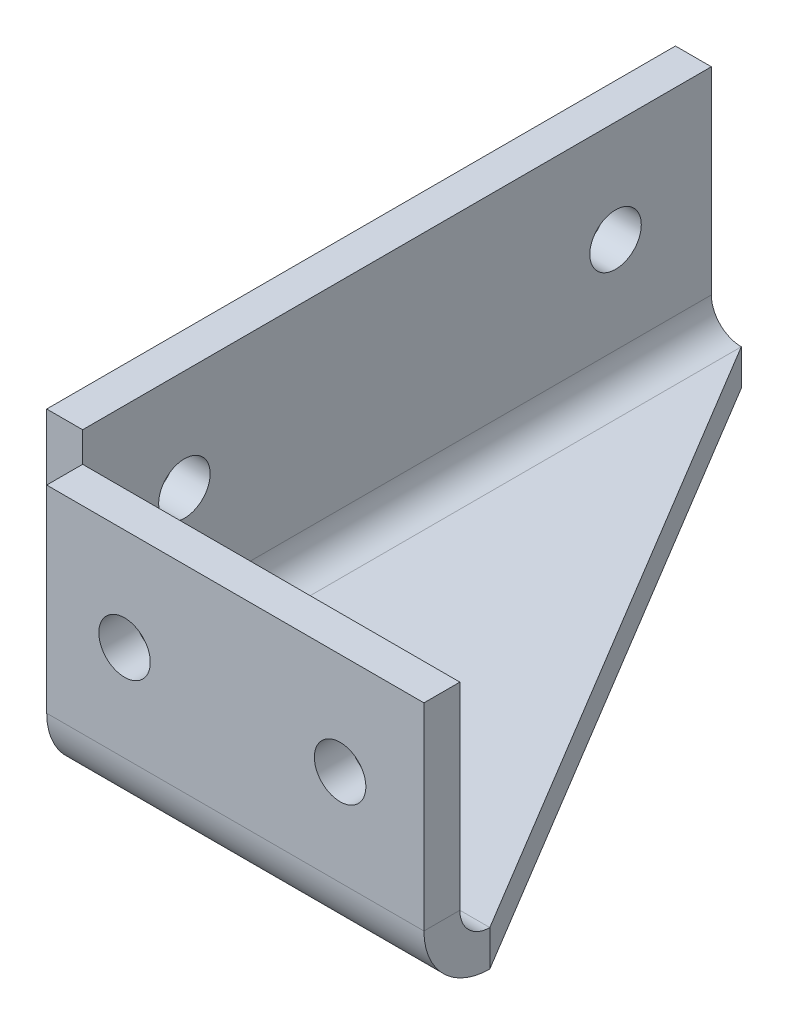
ISO-10303-21;
HEADER;
FILE_DESCRIPTION(('STEP AP214'),'2;1');
FILE_NAME('part.step','',(''),(''),'','','');
FILE_SCHEMA(('AUTOMOTIVE_DESIGN { 1 0 10303 214 1 1 1 1 }'));
ENDSEC;
DATA;
#1=APPLICATION_CONTEXT('core data for automotive mechanical design processes');
#2=APPLICATION_PROTOCOL_DEFINITION('international standard','automotive_design',2000,#1);
#3=PRODUCT_CONTEXT('',#1,'mechanical');
#4=PRODUCT('Part','Part','',(#3));
#5=PRODUCT_RELATED_PRODUCT_CATEGORY('part','',(#4));
#6=PRODUCT_DEFINITION_FORMATION('','',#4);
#7=PRODUCT_DEFINITION_CONTEXT('part definition',#1,'design');
#8=PRODUCT_DEFINITION('design','',#6,#7);
#9=PRODUCT_DEFINITION_SHAPE('','',#8);
#10=(LENGTH_UNIT() NAMED_UNIT(*) SI_UNIT(.MILLI.,.METRE.));
#11=(NAMED_UNIT(*) PLANE_ANGLE_UNIT() SI_UNIT($,.RADIAN.));
#12=(NAMED_UNIT(*) SI_UNIT($,.STERADIAN.) SOLID_ANGLE_UNIT());
#13=UNCERTAINTY_MEASURE_WITH_UNIT(LENGTH_MEASURE(1.E-05),#10,'distance_accuracy_value','');
#14=(GEOMETRIC_REPRESENTATION_CONTEXT(3) GLOBAL_UNCERTAINTY_ASSIGNED_CONTEXT((#13)) GLOBAL_UNIT_ASSIGNED_CONTEXT((#10,
#11,#12)) REPRESENTATION_CONTEXT('',''));
#15=CARTESIAN_POINT('',(0.,0.,0.));
#16=DIRECTION('',(0.,0.,1.));
#17=DIRECTION('',(1.,0.,0.));
#18=AXIS2_PLACEMENT_3D('',#15,#16,#17);
#19=CARTESIAN_POINT('',(0.,-3.,0.));
#20=DIRECTION('',(0.,1.,0.));
#21=DIRECTION('',(0.,0.,1.));
#22=AXIS2_PLACEMENT_3D('',#19,#20,#21);
#23=PLANE('',#22);
#24=DIRECTION('',(0.514495755427527,0.,0.857492925712544));
#25=VECTOR('',#24,1.);
#26=CARTESIAN_POINT('',(0.,-3.,0.));
#27=LINE('',#26,#25);
#28=CARTESIAN_POINT('',(-31.5,-3.,-52.5));
#29=VERTEX_POINT('',#28);
#30=CARTESIAN_POINT('',(0.,-3.,0.));
#31=VERTEX_POINT('',#30);
#32=EDGE_CURVE('E95',#29,#31,#27,.T.);
#33=ORIENTED_EDGE('',*,*,#32,.T.);
#34=DIRECTION('',(1.,0.,0.));
#35=VECTOR('',#34,1.);
#36=CARTESIAN_POINT('',(0.,-3.,0.));
#37=LINE('',#36,#35);
#38=CARTESIAN_POINT('',(-31.5,-2.99999999999999,0.));
#39=VERTEX_POINT('',#38);
#40=EDGE_CURVE('E196',#39,#31,#37,.T.);
#41=ORIENTED_EDGE('',*,*,#40,.F.);
#42=DIRECTION('',(0.,0.,1.));
#43=VECTOR('',#42,1.);
#44=CARTESIAN_POINT('',(-31.5,-3.,0.));
#45=LINE('',#44,#43);
#46=EDGE_CURVE('E172',#29,#39,#45,.T.);
#47=ORIENTED_EDGE('',*,*,#46,.F.);
#48=EDGE_LOOP('',(#33,#41,#47));
#49=FACE_BOUND('',#48,.T.);
#50=ADVANCED_FACE('F78',(#49),#23,.F.);
#51=CARTESIAN_POINT('',(0.,0.,0.));
#52=DIRECTION('',(0.,1.,0.));
#53=DIRECTION('',(0.,0.,1.));
#54=AXIS2_PLACEMENT_3D('',#51,#52,#53);
#55=PLANE('',#54);
#56=DIRECTION('',(1.,0.,0.));
#57=VECTOR('',#56,1.);
#58=CARTESIAN_POINT('',(0.,0.,0.));
#59=LINE('',#58,#57);
#60=CARTESIAN_POINT('',(-31.5,0.,0.));
#61=VERTEX_POINT('',#60);
#62=CARTESIAN_POINT('',(0.,0.,0.));
#63=VERTEX_POINT('',#62);
#64=EDGE_CURVE('E166',#61,#63,#59,.T.);
#65=ORIENTED_EDGE('',*,*,#64,.T.);
#66=DIRECTION('',(0.514495755427527,0.,0.857492925712544));
#67=VECTOR('',#66,1.);
#68=CARTESIAN_POINT('',(0.,0.,0.));
#69=LINE('',#68,#67);
#70=CARTESIAN_POINT('',(-31.5,0.,-52.5));
#71=VERTEX_POINT('',#70);
#72=EDGE_CURVE('E157',#71,#63,#69,.T.);
#73=ORIENTED_EDGE('',*,*,#72,.F.);
#74=DIRECTION('',(0.,0.,1.));
#75=VECTOR('',#74,1.);
#76=CARTESIAN_POINT('',(-31.5,0.,0.));
#77=LINE('',#76,#75);
#78=EDGE_CURVE('E167',#71,#61,#77,.T.);
#79=ORIENTED_EDGE('',*,*,#78,.T.);
#80=EDGE_LOOP('',(#65,#73,#79));
#81=FACE_BOUND('',#80,.T.);
#82=ADVANCED_FACE('F80',(#81),#55,.T.);
#83=CARTESIAN_POINT('',(-31.5,2.49999999999999,0.));
#84=DIRECTION('',(-1.,0.,0.));
#85=DIRECTION('',(0.,0.,1.));
#86=AXIS2_PLACEMENT_3D('',#83,#84,#85);
#87=PLANE('',#86);
#88=DIRECTION('',(0.,0.,-1.));
#89=VECTOR('',#88,1.);
#90=CARTESIAN_POINT('',(-31.5,2.49999999999999,5.49999999999999));
#91=LINE('',#90,#89);
#92=CARTESIAN_POINT('',(-31.5,2.49999999999999,2.49999999999999));
#93=VERTEX_POINT('',#92);
#94=CARTESIAN_POINT('',(-31.5,2.49999999999999,5.49999999999999));
#95=VERTEX_POINT('',#94);
#96=EDGE_CURVE('E250',#93,#95,#91,.F.);
#97=ORIENTED_EDGE('',*,*,#96,.F.);
#98=CARTESIAN_POINT('',(-31.5,2.49999999999999,0.));
#99=DIRECTION('',(1.,0.,0.));
#100=DIRECTION('',(0.,0.,-1.));
#101=AXIS2_PLACEMENT_3D('',#98,#99,#100);
#102=CIRCLE('',#101,2.49999999999999);
#103=EDGE_CURVE('E185',#61,#93,#102,.F.);
#104=ORIENTED_EDGE('',*,*,#103,.F.);
#105=DIRECTION('',(0.,1.,0.));
#106=VECTOR('',#105,1.);
#107=CARTESIAN_POINT('',(-31.5,-3.,0.));
#108=LINE('',#107,#106);
#109=EDGE_CURVE('E88',#39,#61,#108,.T.);
#110=ORIENTED_EDGE('',*,*,#109,.F.);
#111=CARTESIAN_POINT('',(-31.5,2.49999999999999,0.));
#112=DIRECTION('',(1.,0.,0.));
#113=DIRECTION('',(0.,0.,-1.));
#114=AXIS2_PLACEMENT_3D('',#111,#112,#113);
#115=CIRCLE('',#114,5.49999999999999);
#116=EDGE_CURVE('E199',#39,#95,#115,.F.);
#117=ORIENTED_EDGE('',*,*,#116,.T.);
#118=EDGE_LOOP('',(#97,#104,#110,#117));
#119=FACE_BOUND('',#118,.T.);
#120=ADVANCED_FACE('F254',(#119),#87,.T.);
#121=CARTESIAN_POINT('',(0.,2.49999999999999,0.));
#122=DIRECTION('',(-1.,0.,0.));
#123=DIRECTION('',(0.,0.,1.));
#124=AXIS2_PLACEMENT_3D('',#121,#122,#123);
#125=PLANE('',#124);
#126=CARTESIAN_POINT('',(0.,2.49999999999999,0.));
#127=DIRECTION('',(1.,0.,0.));
#128=DIRECTION('',(0.,0.,-1.));
#129=AXIS2_PLACEMENT_3D('',#126,#127,#128);
#130=CIRCLE('',#129,2.49999999999999);
#131=CARTESIAN_POINT('',(0.,2.49999999999999,2.49999999999999));
#132=VERTEX_POINT('',#131);
#133=EDGE_CURVE('E179',#132,#63,#130,.T.);
#134=ORIENTED_EDGE('',*,*,#133,.F.);
#135=DIRECTION('',(0.,0.,-1.));
#136=VECTOR('',#135,1.);
#137=CARTESIAN_POINT('',(0.,2.49999999999999,2.5));
#138=LINE('',#137,#136);
#139=CARTESIAN_POINT('',(0.,2.49999999999999,5.49999999999999));
#140=VERTEX_POINT('',#139);
#141=EDGE_CURVE('E247',#132,#140,#138,.F.);
#142=ORIENTED_EDGE('',*,*,#141,.T.);
#143=CARTESIAN_POINT('',(0.,2.49999999999999,0.));
#144=DIRECTION('',(1.,0.,0.));
#145=DIRECTION('',(0.,0.,-1.));
#146=AXIS2_PLACEMENT_3D('',#143,#144,#145);
#147=CIRCLE('',#146,5.49999999999999);
#148=EDGE_CURVE('E181',#140,#31,#147,.T.);
#149=ORIENTED_EDGE('',*,*,#148,.T.);
#150=DIRECTION('',(0.,1.,0.));
#151=VECTOR('',#150,1.);
#152=CARTESIAN_POINT('',(0.,-3.,0.));
#153=LINE('',#152,#151);
#154=EDGE_CURVE('E13',#31,#63,#153,.T.);
#155=ORIENTED_EDGE('',*,*,#154,.T.);
#156=EDGE_LOOP('',(#134,#142,#149,#155));
#157=FACE_BOUND('',#156,.T.);
#158=ADVANCED_FACE('F177',(#157),#125,.F.);
#159=CARTESIAN_POINT('',(0.,2.49999999999999,0.));
#160=DIRECTION('',(1.,0.,0.));
#161=DIRECTION('',(0.,0.,1.));
#162=AXIS2_PLACEMENT_3D('',#159,#160,#161);
#163=CYLINDRICAL_SURFACE('',#162,5.49999999999999);
#164=ORIENTED_EDGE('',*,*,#40,.T.);
#165=ORIENTED_EDGE('',*,*,#148,.F.);
#166=DIRECTION('',(1.,0.,0.));
#167=VECTOR('',#166,1.);
#168=CARTESIAN_POINT('',(-31.5,2.49999999999999,5.49999999999999));
#169=LINE('',#168,#167);
#170=EDGE_CURVE('E245',#140,#95,#169,.F.);
#171=ORIENTED_EDGE('',*,*,#170,.T.);
#172=ORIENTED_EDGE('',*,*,#116,.F.);
#173=EDGE_LOOP('',(#164,#165,#171,#172));
#174=FACE_BOUND('',#173,.T.);
#175=ADVANCED_FACE('F282',(#174),#163,.T.);
#176=CARTESIAN_POINT('',(0.,2.49999999999999,0.));
#177=DIRECTION('',(1.,0.,0.));
#178=DIRECTION('',(0.,0.,1.));
#179=AXIS2_PLACEMENT_3D('',#176,#177,#178);
#180=CYLINDRICAL_SURFACE('',#179,2.49999999999999);
#181=ORIENTED_EDGE('',*,*,#64,.F.);
#182=ORIENTED_EDGE('',*,*,#103,.T.);
#183=DIRECTION('',(1.,0.,0.));
#184=VECTOR('',#183,1.);
#185=CARTESIAN_POINT('',(-31.5,2.49999999999999,2.49999999999999));
#186=LINE('',#185,#184);
#187=EDGE_CURVE('E184',#93,#132,#186,.T.);
#188=ORIENTED_EDGE('',*,*,#187,.T.);
#189=ORIENTED_EDGE('',*,*,#133,.T.);
#190=EDGE_LOOP('',(#181,#182,#188,#189));
#191=FACE_BOUND('',#190,.T.);
#192=ADVANCED_FACE('F182',(#191),#180,.F.);
#193=CARTESIAN_POINT('',(0.,19.,5.49999999999999));
#194=DIRECTION('',(-1.,0.,0.));
#195=DIRECTION('',(0.,-1.,0.));
#196=AXIS2_PLACEMENT_3D('',#193,#194,#195);
#197=PLANE('',#196);
#198=ORIENTED_EDGE('',*,*,#141,.F.);
#199=DIRECTION('',(0.,-1.,0.));
#200=VECTOR('',#199,1.);
#201=CARTESIAN_POINT('',(0.,19.,2.49999999999999));
#202=LINE('',#201,#200);
#203=CARTESIAN_POINT('',(0.,19.,2.49999999999999));
#204=VERTEX_POINT('',#203);
#205=EDGE_CURVE('E243',#132,#204,#202,.F.);
#206=ORIENTED_EDGE('',*,*,#205,.T.);
#207=DIRECTION('',(0.,0.,-1.));
#208=VECTOR('',#207,1.);
#209=CARTESIAN_POINT('',(0.,19.,5.49999999999999));
#210=LINE('',#209,#208);
#211=CARTESIAN_POINT('',(0.,19.,5.49999999999999));
#212=VERTEX_POINT('',#211);
#213=EDGE_CURVE('E186',#212,#204,#210,.T.);
#214=ORIENTED_EDGE('',*,*,#213,.F.);
#215=DIRECTION('',(0.,1.,0.));
#216=VECTOR('',#215,1.);
#217=CARTESIAN_POINT('',(0.,0.,5.49999999999999));
#218=LINE('',#217,#216);
#219=EDGE_CURVE('E236',#140,#212,#218,.T.);
#220=ORIENTED_EDGE('',*,*,#219,.F.);
#221=EDGE_LOOP('',(#198,#206,#214,#220));
#222=FACE_BOUND('',#221,.T.);
#223=ADVANCED_FACE('F274',(#222),#197,.F.);
#224=CARTESIAN_POINT('',(-31.5,0.,5.49999999999999));
#225=DIRECTION('',(1.,0.,0.));
#226=DIRECTION('',(0.,0.,-1.));
#227=AXIS2_PLACEMENT_3D('',#224,#225,#226);
#228=PLANE('',#227);
#229=ORIENTED_EDGE('',*,*,#96,.T.);
#230=DIRECTION('',(0.,-1.,0.));
#231=VECTOR('',#230,1.);
#232=CARTESIAN_POINT('',(-31.5,0.,5.49999999999999));
#233=LINE('',#232,#231);
#234=CARTESIAN_POINT('',(-31.5,19.,5.49999999999999));
#235=VERTEX_POINT('',#234);
#236=EDGE_CURVE('E231',#235,#95,#233,.T.);
#237=ORIENTED_EDGE('',*,*,#236,.F.);
#238=DIRECTION('',(0.,0.,-1.));
#239=VECTOR('',#238,1.);
#240=CARTESIAN_POINT('',(-31.5,19.,5.49999999999999));
#241=LINE('',#240,#239);
#242=CARTESIAN_POINT('',(-31.5,19.,2.49999999999999));
#243=VERTEX_POINT('',#242);
#244=EDGE_CURVE('E190',#235,#243,#241,.T.);
#245=ORIENTED_EDGE('',*,*,#244,.T.);
#246=DIRECTION('',(0.,1.,0.));
#247=VECTOR('',#246,1.);
#248=CARTESIAN_POINT('',(-31.5,0.,2.49999999999999));
#249=LINE('',#248,#247);
#250=EDGE_CURVE('E238',#243,#93,#249,.F.);
#251=ORIENTED_EDGE('',*,*,#250,.T.);
#252=EDGE_LOOP('',(#229,#237,#245,#251));
#253=FACE_BOUND('',#252,.T.);
#254=ADVANCED_FACE('F258',(#253),#228,.F.);
#255=CARTESIAN_POINT('',(0.,0.,5.49999999999999));
#256=DIRECTION('',(0.,0.,-1.));
#257=DIRECTION('',(-1.,0.,0.));
#258=AXIS2_PLACEMENT_3D('',#255,#256,#257);
#259=PLANE('',#258);
#260=CARTESIAN_POINT('',(-7.,10.5,5.49999999999999));
#261=DIRECTION('',(0.,0.,-1.));
#262=DIRECTION('',(-1.,0.,0.));
#263=AXIS2_PLACEMENT_3D('',#260,#261,#262);
#264=CIRCLE('',#263,2.15);
#265=CARTESIAN_POINT('',(-9.15,10.5,5.49999999999999));
#266=VERTEX_POINT('',#265);
#267=EDGE_CURVE('E336',#266,#266,#264,.T.);
#268=ORIENTED_EDGE('',*,*,#267,.T.);
#269=EDGE_LOOP('',(#268));
#270=FACE_BOUND('',#269,.T.);
#271=CARTESIAN_POINT('',(-25.,10.5,5.49999999999999));
#272=DIRECTION('',(0.,0.,-1.));
#273=DIRECTION('',(-1.,0.,0.));
#274=AXIS2_PLACEMENT_3D('',#271,#272,#273);
#275=CIRCLE('',#274,2.15);
#276=CARTESIAN_POINT('',(-27.15,10.5,5.49999999999999));
#277=VERTEX_POINT('',#276);
#278=EDGE_CURVE('E329',#277,#277,#275,.T.);
#279=ORIENTED_EDGE('',*,*,#278,.T.);
#280=EDGE_LOOP('',(#279));
#281=FACE_BOUND('',#280,.T.);
#282=ORIENTED_EDGE('',*,*,#170,.F.);
#283=ORIENTED_EDGE('',*,*,#219,.T.);
#284=DIRECTION('',(-1.,0.,0.));
#285=VECTOR('',#284,1.);
#286=CARTESIAN_POINT('',(0.,19.,5.49999999999999));
#287=LINE('',#286,#285);
#288=EDGE_CURVE('E234',#212,#235,#287,.T.);
#289=ORIENTED_EDGE('',*,*,#288,.T.);
#290=ORIENTED_EDGE('',*,*,#236,.T.);
#291=EDGE_LOOP('',(#282,#283,#289,#290));
#292=FACE_BOUND('',#291,.T.);
#293=ADVANCED_FACE('F262',(#270,#281,#292),#259,.F.);
#294=CARTESIAN_POINT('',(0.,0.,2.49999999999999));
#295=DIRECTION('',(0.,0.,-1.));
#296=DIRECTION('',(-1.,0.,0.));
#297=AXIS2_PLACEMENT_3D('',#294,#295,#296);
#298=PLANE('',#297);
#299=CARTESIAN_POINT('',(-7.,10.5,2.49999999999999));
#300=DIRECTION('',(0.,0.,-1.));
#301=DIRECTION('',(-1.,0.,0.));
#302=AXIS2_PLACEMENT_3D('',#299,#300,#301);
#303=CIRCLE('',#302,2.14999999999999);
#304=CARTESIAN_POINT('',(-9.14999999999999,10.5,2.49999999999999));
#305=VERTEX_POINT('',#304);
#306=EDGE_CURVE('E339',#305,#305,#303,.T.);
#307=ORIENTED_EDGE('',*,*,#306,.F.);
#308=EDGE_LOOP('',(#307));
#309=FACE_BOUND('',#308,.T.);
#310=CARTESIAN_POINT('',(-25.,10.5,2.49999999999999));
#311=DIRECTION('',(0.,0.,-1.));
#312=DIRECTION('',(-1.,0.,0.));
#313=AXIS2_PLACEMENT_3D('',#310,#311,#312);
#314=CIRCLE('',#313,2.14999999999999);
#315=CARTESIAN_POINT('',(-27.15,10.5,2.49999999999999));
#316=VERTEX_POINT('',#315);
#317=EDGE_CURVE('E333',#316,#316,#314,.T.);
#318=ORIENTED_EDGE('',*,*,#317,.F.);
#319=EDGE_LOOP('',(#318));
#320=FACE_BOUND('',#319,.T.);
#321=ORIENTED_EDGE('',*,*,#205,.F.);
#322=ORIENTED_EDGE('',*,*,#187,.F.);
#323=ORIENTED_EDGE('',*,*,#250,.F.);
#324=DIRECTION('',(1.,0.,0.));
#325=VECTOR('',#324,1.);
#326=CARTESIAN_POINT('',(-31.5,19.,2.49999999999999));
#327=LINE('',#326,#325);
#328=EDGE_CURVE('E241',#204,#243,#327,.F.);
#329=ORIENTED_EDGE('',*,*,#328,.F.);
#330=EDGE_LOOP('',(#321,#322,#323,#329));
#331=FACE_BOUND('',#330,.T.);
#332=ADVANCED_FACE('F272',(#309,#320,#331),#298,.T.);
#333=CARTESIAN_POINT('',(-31.5,19.,5.49999999999999));
#334=DIRECTION('',(0.,-1.,0.));
#335=DIRECTION('',(0.,0.,-1.));
#336=AXIS2_PLACEMENT_3D('',#333,#334,#335);
#337=PLANE('',#336);
#338=ORIENTED_EDGE('',*,*,#328,.T.);
#339=ORIENTED_EDGE('',*,*,#244,.F.);
#340=ORIENTED_EDGE('',*,*,#288,.F.);
#341=ORIENTED_EDGE('',*,*,#213,.T.);
#342=EDGE_LOOP('',(#338,#339,#340,#341));
#343=FACE_BOUND('',#342,.T.);
#344=ADVANCED_FACE('F268',(#343),#337,.F.);
#345=CARTESIAN_POINT('',(-31.5,2.5,-52.5));
#346=DIRECTION('',(0.,0.,-1.));
#347=DIRECTION('',(-1.,0.,0.));
#348=AXIS2_PLACEMENT_3D('',#345,#346,#347);
#349=PLANE('',#348);
#350=DIRECTION('',(1.,0.,0.));
#351=VECTOR('',#350,1.);
#352=CARTESIAN_POINT('',(-37.,2.49999999999998,-52.5));
#353=LINE('',#352,#351);
#354=CARTESIAN_POINT('',(-34.,2.49999999999999,-52.5));
#355=VERTEX_POINT('',#354);
#356=CARTESIAN_POINT('',(-37.,2.49999999999998,-52.5));
#357=VERTEX_POINT('',#356);
#358=EDGE_CURVE('E163',#355,#357,#353,.F.);
#359=ORIENTED_EDGE('',*,*,#358,.F.);
#360=CARTESIAN_POINT('',(-31.5,2.5,-52.5));
#361=DIRECTION('',(0.,0.,1.));
#362=DIRECTION('',(1.,0.,0.));
#363=AXIS2_PLACEMENT_3D('',#360,#361,#362);
#364=CIRCLE('',#363,2.5);
#365=EDGE_CURVE('E220',#71,#355,#364,.F.);
#366=ORIENTED_EDGE('',*,*,#365,.F.);
#367=DIRECTION('',(0.,1.,0.));
#368=VECTOR('',#367,1.);
#369=CARTESIAN_POINT('',(-31.5,-3.,-52.5));
#370=LINE('',#369,#368);
#371=EDGE_CURVE('E82',#29,#71,#370,.T.);
#372=ORIENTED_EDGE('',*,*,#371,.F.);
#373=CARTESIAN_POINT('',(-31.5,2.5,-52.5));
#374=DIRECTION('',(0.,0.,1.));
#375=DIRECTION('',(1.,0.,0.));
#376=AXIS2_PLACEMENT_3D('',#373,#374,#375);
#377=CIRCLE('',#376,5.5);
#378=EDGE_CURVE('E253',#29,#357,#377,.F.);
#379=ORIENTED_EDGE('',*,*,#378,.T.);
#380=EDGE_LOOP('',(#359,#366,#372,#379));
#381=FACE_BOUND('',#380,.T.);
#382=ADVANCED_FACE('F379',(#381),#349,.T.);
#383=CARTESIAN_POINT('',(-31.5,2.5,0.));
#384=DIRECTION('',(0.,0.,-1.));
#385=DIRECTION('',(-1.,0.,0.));
#386=AXIS2_PLACEMENT_3D('',#383,#384,#385);
#387=PLANE('',#386);
#388=CARTESIAN_POINT('',(-31.5,2.5,0.));
#389=DIRECTION('',(0.,0.,1.));
#390=DIRECTION('',(1.,0.,0.));
#391=AXIS2_PLACEMENT_3D('',#388,#389,#390);
#392=CIRCLE('',#391,2.5);
#393=CARTESIAN_POINT('',(-34.,2.49999999999999,0.));
#394=VERTEX_POINT('',#393);
#395=EDGE_CURVE('E208',#394,#61,#392,.T.);
#396=ORIENTED_EDGE('',*,*,#395,.F.);
#397=DIRECTION('',(1.,0.,0.));
#398=VECTOR('',#397,1.);
#399=CARTESIAN_POINT('',(-34.,2.49999999999999,0.));
#400=LINE('',#399,#398);
#401=CARTESIAN_POINT('',(-37.,2.49999999999998,0.));
#402=VERTEX_POINT('',#401);
#403=EDGE_CURVE('E310',#394,#402,#400,.F.);
#404=ORIENTED_EDGE('',*,*,#403,.T.);
#405=CARTESIAN_POINT('',(-31.5,2.5,0.));
#406=DIRECTION('',(0.,0.,1.));
#407=DIRECTION('',(1.,0.,0.));
#408=AXIS2_PLACEMENT_3D('',#405,#406,#407);
#409=CIRCLE('',#408,5.5);
#410=EDGE_CURVE('E210',#402,#39,#409,.T.);
#411=ORIENTED_EDGE('',*,*,#410,.T.);
#412=ORIENTED_EDGE('',*,*,#109,.T.);
#413=EDGE_LOOP('',(#396,#404,#411,#412));
#414=FACE_BOUND('',#413,.T.);
#415=ADVANCED_FACE('F206',(#414),#387,.F.);
#416=CARTESIAN_POINT('',(-31.5,2.5,0.));
#417=DIRECTION('',(0.,0.,1.));
#418=DIRECTION('',(-1.,0.,0.));
#419=AXIS2_PLACEMENT_3D('',#416,#417,#418);
#420=CYLINDRICAL_SURFACE('',#419,5.5);
#421=ORIENTED_EDGE('',*,*,#46,.T.);
#422=ORIENTED_EDGE('',*,*,#410,.F.);
#423=DIRECTION('',(0.,0.,1.));
#424=VECTOR('',#423,1.);
#425=CARTESIAN_POINT('',(-37.,2.49999999999998,-52.5));
#426=LINE('',#425,#424);
#427=EDGE_CURVE('E303',#402,#357,#426,.F.);
#428=ORIENTED_EDGE('',*,*,#427,.T.);
#429=ORIENTED_EDGE('',*,*,#378,.F.);
#430=EDGE_LOOP('',(#421,#422,#428,#429));
#431=FACE_BOUND('',#430,.T.);
#432=ADVANCED_FACE('F300',(#431),#420,.T.);
#433=CARTESIAN_POINT('',(-31.5,2.5,0.));
#434=DIRECTION('',(0.,0.,1.));
#435=DIRECTION('',(-1.,0.,0.));
#436=AXIS2_PLACEMENT_3D('',#433,#434,#435);
#437=CYLINDRICAL_SURFACE('',#436,2.5);
#438=ORIENTED_EDGE('',*,*,#78,.F.);
#439=ORIENTED_EDGE('',*,*,#365,.T.);
#440=DIRECTION('',(0.,0.,1.));
#441=VECTOR('',#440,1.);
#442=CARTESIAN_POINT('',(-34.,2.49999999999999,-52.5));
#443=LINE('',#442,#441);
#444=EDGE_CURVE('E219',#355,#394,#443,.T.);
#445=ORIENTED_EDGE('',*,*,#444,.T.);
#446=ORIENTED_EDGE('',*,*,#395,.T.);
#447=EDGE_LOOP('',(#438,#439,#445,#446));
#448=FACE_BOUND('',#447,.T.);
#449=ADVANCED_FACE('F215',(#448),#437,.F.);
#450=CARTESIAN_POINT('',(-37.,0.,-52.5));
#451=DIRECTION('',(0.,0.,1.));
#452=DIRECTION('',(1.,0.,0.));
#453=AXIS2_PLACEMENT_3D('',#450,#451,#452);
#454=PLANE('',#453);
#455=ORIENTED_EDGE('',*,*,#358,.T.);
#456=DIRECTION('',(0.,-1.,0.));
#457=VECTOR('',#456,1.);
#458=CARTESIAN_POINT('',(-37.,-1.25514000844465E-13,-52.5));
#459=LINE('',#458,#457);
#460=CARTESIAN_POINT('',(-37.0000000000001,19.,-52.5));
#461=VERTEX_POINT('',#460);
#462=EDGE_CURVE('E320',#461,#357,#459,.T.);
#463=ORIENTED_EDGE('',*,*,#462,.F.);
#464=DIRECTION('',(1.,0.,0.));
#465=VECTOR('',#464,1.);
#466=CARTESIAN_POINT('',(-37.0000000000001,19.,-52.5));
#467=LINE('',#466,#465);
#468=CARTESIAN_POINT('',(-34.0000000000001,19.,-52.5));
#469=VERTEX_POINT('',#468);
#470=EDGE_CURVE('E225',#461,#469,#467,.T.);
#471=ORIENTED_EDGE('',*,*,#470,.T.);
#472=DIRECTION('',(0.,1.,0.));
#473=VECTOR('',#472,1.);
#474=CARTESIAN_POINT('',(-34.,0.,-52.5));
#475=LINE('',#474,#473);
#476=EDGE_CURVE('E313',#469,#355,#475,.F.);
#477=ORIENTED_EDGE('',*,*,#476,.T.);
#478=EDGE_LOOP('',(#455,#463,#471,#477));
#479=FACE_BOUND('',#478,.T.);
#480=ADVANCED_FACE('F378',(#479),#454,.F.);
#481=CARTESIAN_POINT('',(-37.0000000000001,19.,0.));
#482=DIRECTION('',(0.,0.,-1.));
#483=DIRECTION('',(0.,1.,0.));
#484=AXIS2_PLACEMENT_3D('',#481,#482,#483);
#485=PLANE('',#484);
#486=ORIENTED_EDGE('',*,*,#403,.F.);
#487=DIRECTION('',(0.,-1.,0.));
#488=VECTOR('',#487,1.);
#489=CARTESIAN_POINT('',(-34.0000000000001,19.,0.));
#490=LINE('',#489,#488);
#491=CARTESIAN_POINT('',(-34.0000000000001,19.,0.));
#492=VERTEX_POINT('',#491);
#493=EDGE_CURVE('E316',#394,#492,#490,.F.);
#494=ORIENTED_EDGE('',*,*,#493,.T.);
#495=DIRECTION('',(1.,0.,0.));
#496=VECTOR('',#495,1.);
#497=CARTESIAN_POINT('',(-37.0000000000001,19.,0.));
#498=LINE('',#497,#496);
#499=CARTESIAN_POINT('',(-37.0000000000001,19.,0.));
#500=VERTEX_POINT('',#499);
#501=EDGE_CURVE('E221',#500,#492,#498,.T.);
#502=ORIENTED_EDGE('',*,*,#501,.F.);
#503=DIRECTION('',(0.,1.,0.));
#504=VECTOR('',#503,1.);
#505=CARTESIAN_POINT('',(-37.,-1.25514000844465E-13,0.));
#506=LINE('',#505,#504);
#507=EDGE_CURVE('E323',#402,#500,#506,.T.);
#508=ORIENTED_EDGE('',*,*,#507,.F.);
#509=EDGE_LOOP('',(#486,#494,#502,#508));
#510=FACE_BOUND('',#509,.T.);
#511=ADVANCED_FACE('F370',(#510),#485,.F.);
#512=CARTESIAN_POINT('',(-37.,-1.25514000844465E-13,0.));
#513=DIRECTION('',(1.,0.,0.));
#514=DIRECTION('',(0.,1.,0.));
#515=AXIS2_PLACEMENT_3D('',#512,#513,#514);
#516=PLANE('',#515);
#517=CARTESIAN_POINT('',(-37.0000000000001,10.5,-44.5));
#518=DIRECTION('',(1.,0.,0.));
#519=DIRECTION('',(0.,0.,-1.));
#520=AXIS2_PLACEMENT_3D('',#517,#518,#519);
#521=CIRCLE('',#520,2.15);
#522=CARTESIAN_POINT('',(-37.0000000000001,10.5,-46.65));
#523=VERTEX_POINT('',#522);
#524=EDGE_CURVE('E348',#523,#523,#521,.T.);
#525=ORIENTED_EDGE('',*,*,#524,.T.);
#526=EDGE_LOOP('',(#525));
#527=FACE_BOUND('',#526,.T.);
#528=CARTESIAN_POINT('',(-37.0000000000001,10.5,-8.49999999999999));
#529=DIRECTION('',(1.,0.,0.));
#530=DIRECTION('',(0.,0.,-1.));
#531=AXIS2_PLACEMENT_3D('',#528,#529,#530);
#532=CIRCLE('',#531,2.15);
#533=CARTESIAN_POINT('',(-37.0000000000001,10.5,-10.65));
#534=VERTEX_POINT('',#533);
#535=EDGE_CURVE('E342',#534,#534,#532,.T.);
#536=ORIENTED_EDGE('',*,*,#535,.T.);
#537=EDGE_LOOP('',(#536));
#538=FACE_BOUND('',#537,.T.);
#539=ORIENTED_EDGE('',*,*,#427,.F.);
#540=ORIENTED_EDGE('',*,*,#507,.T.);
#541=DIRECTION('',(0.,0.,-1.));
#542=VECTOR('',#541,1.);
#543=CARTESIAN_POINT('',(-37.0000000000001,19.,0.));
#544=LINE('',#543,#542);
#545=EDGE_CURVE('E325',#500,#461,#544,.T.);
#546=ORIENTED_EDGE('',*,*,#545,.T.);
#547=ORIENTED_EDGE('',*,*,#462,.T.);
#548=EDGE_LOOP('',(#539,#540,#546,#547));
#549=FACE_BOUND('',#548,.T.);
#550=ADVANCED_FACE('F361',(#527,#538,#549),#516,.F.);
#551=CARTESIAN_POINT('',(-34.,-1.15039556827936E-13,0.));
#552=DIRECTION('',(1.,0.,0.));
#553=DIRECTION('',(0.,1.,0.));
#554=AXIS2_PLACEMENT_3D('',#551,#552,#553);
#555=PLANE('',#554);
#556=CARTESIAN_POINT('',(-34.,10.5,-44.5));
#557=DIRECTION('',(1.,0.,0.));
#558=DIRECTION('',(0.,0.,-1.));
#559=AXIS2_PLACEMENT_3D('',#556,#557,#558);
#560=CIRCLE('',#559,2.14999999999999);
#561=CARTESIAN_POINT('',(-34.,10.5,-46.65));
#562=VERTEX_POINT('',#561);
#563=EDGE_CURVE('E351',#562,#562,#560,.T.);
#564=ORIENTED_EDGE('',*,*,#563,.F.);
#565=EDGE_LOOP('',(#564));
#566=FACE_BOUND('',#565,.T.);
#567=CARTESIAN_POINT('',(-34.,10.5,-8.49999999999999));
#568=DIRECTION('',(1.,0.,0.));
#569=DIRECTION('',(0.,0.,-1.));
#570=AXIS2_PLACEMENT_3D('',#567,#568,#569);
#571=CIRCLE('',#570,2.14999999999999);
#572=CARTESIAN_POINT('',(-34.,10.5,-10.65));
#573=VERTEX_POINT('',#572);
#574=EDGE_CURVE('E345',#573,#573,#571,.T.);
#575=ORIENTED_EDGE('',*,*,#574,.F.);
#576=EDGE_LOOP('',(#575));
#577=FACE_BOUND('',#576,.T.);
#578=ORIENTED_EDGE('',*,*,#493,.F.);
#579=ORIENTED_EDGE('',*,*,#444,.F.);
#580=ORIENTED_EDGE('',*,*,#476,.F.);
#581=DIRECTION('',(0.,0.,1.));
#582=VECTOR('',#581,1.);
#583=CARTESIAN_POINT('',(-34.0000000000001,19.,-52.5));
#584=LINE('',#583,#582);
#585=EDGE_CURVE('E318',#492,#469,#584,.F.);
#586=ORIENTED_EDGE('',*,*,#585,.F.);
#587=EDGE_LOOP('',(#578,#579,#580,#586));
#588=FACE_BOUND('',#587,.T.);
#589=ADVANCED_FACE('F357',(#566,#577,#588),#555,.T.);
#590=CARTESIAN_POINT('',(-37.0000000000001,19.,-52.5));
#591=DIRECTION('',(0.,-1.,0.));
#592=DIRECTION('',(1.,0.,0.));
#593=AXIS2_PLACEMENT_3D('',#590,#591,#592);
#594=PLANE('',#593);
#595=ORIENTED_EDGE('',*,*,#585,.T.);
#596=ORIENTED_EDGE('',*,*,#470,.F.);
#597=ORIENTED_EDGE('',*,*,#545,.F.);
#598=ORIENTED_EDGE('',*,*,#501,.T.);
#599=EDGE_LOOP('',(#595,#596,#597,#598));
#600=FACE_BOUND('',#599,.T.);
#601=ADVANCED_FACE('F360',(#600),#594,.F.);
#602=CARTESIAN_POINT('',(0.,-3.,0.));
#603=DIRECTION('',(-0.857492925712544,0.,0.514495755427527));
#604=DIRECTION('',(0.514495755427527,0.,0.857492925712544));
#605=AXIS2_PLACEMENT_3D('',#602,#603,#604);
#606=PLANE('',#605);
#607=ORIENTED_EDGE('',*,*,#154,.F.);
#608=ORIENTED_EDGE('',*,*,#32,.F.);
#609=ORIENTED_EDGE('',*,*,#371,.T.);
#610=ORIENTED_EDGE('',*,*,#72,.T.);
#611=EDGE_LOOP('',(#607,#608,#609,#610));
#612=FACE_BOUND('',#611,.T.);
#613=ADVANCED_FACE('F159',(#612),#606,.F.);
#614=CARTESIAN_POINT('',(-25.,10.5,2.49999999999999));
#615=DIRECTION('',(0.,0.,-1.));
#616=DIRECTION('',(-1.,0.,0.));
#617=AXIS2_PLACEMENT_3D('',#614,#615,#616);
#618=CYLINDRICAL_SURFACE('',#617,2.14999999999999);
#619=ORIENTED_EDGE('',*,*,#278,.F.);
#620=EDGE_LOOP('',(#619));
#621=FACE_BOUND('',#620,.T.);
#622=ORIENTED_EDGE('',*,*,#317,.T.);
#623=EDGE_LOOP('',(#622));
#624=FACE_BOUND('',#623,.T.);
#625=ADVANCED_FACE('F401',(#621,#624),#618,.F.);
#626=CARTESIAN_POINT('',(-7.,10.5,2.49999999999999));
#627=DIRECTION('',(0.,0.,-1.));
#628=DIRECTION('',(-1.,0.,0.));
#629=AXIS2_PLACEMENT_3D('',#626,#627,#628);
#630=CYLINDRICAL_SURFACE('',#629,2.14999999999999);
#631=ORIENTED_EDGE('',*,*,#267,.F.);
#632=EDGE_LOOP('',(#631));
#633=FACE_BOUND('',#632,.T.);
#634=ORIENTED_EDGE('',*,*,#306,.T.);
#635=EDGE_LOOP('',(#634));
#636=FACE_BOUND('',#635,.T.);
#637=ADVANCED_FACE('F403',(#633,#636),#630,.F.);
#638=CARTESIAN_POINT('',(-34.,10.5,-8.49999999999999));
#639=DIRECTION('',(1.,0.,0.));
#640=DIRECTION('',(0.,0.,-1.));
#641=AXIS2_PLACEMENT_3D('',#638,#639,#640);
#642=CYLINDRICAL_SURFACE('',#641,2.14999999999999);
#643=ORIENTED_EDGE('',*,*,#535,.F.);
#644=EDGE_LOOP('',(#643));
#645=FACE_BOUND('',#644,.T.);
#646=ORIENTED_EDGE('',*,*,#574,.T.);
#647=EDGE_LOOP('',(#646));
#648=FACE_BOUND('',#647,.T.);
#649=ADVANCED_FACE('F410',(#645,#648),#642,.F.);
#650=CARTESIAN_POINT('',(-34.,10.5,-44.5));
#651=DIRECTION('',(1.,0.,0.));
#652=DIRECTION('',(0.,0.,-1.));
#653=AXIS2_PLACEMENT_3D('',#650,#651,#652);
#654=CYLINDRICAL_SURFACE('',#653,2.14999999999999);
#655=ORIENTED_EDGE('',*,*,#524,.F.);
#656=EDGE_LOOP('',(#655));
#657=FACE_BOUND('',#656,.T.);
#658=ORIENTED_EDGE('',*,*,#563,.T.);
#659=EDGE_LOOP('',(#658));
#660=FACE_BOUND('',#659,.T.);
#661=ADVANCED_FACE('F355',(#657,#660),#654,.F.);
#662=CLOSED_SHELL('',(#50,#82,#120,#158,#175,#192,#223,#254,#293,#332,#344,#382,#415,#432,#449,
#480,#511,#550,#589,#601,#613,#625,#637,#649,#661));
#663=MANIFOLD_SOLID_BREP('B2',#662);
#664=ADVANCED_BREP_SHAPE_REPRESENTATION('',(#18,#663),#14);
#665=SHAPE_DEFINITION_REPRESENTATION(#9,#664);
ENDSEC;
END-ISO-10303-21;
